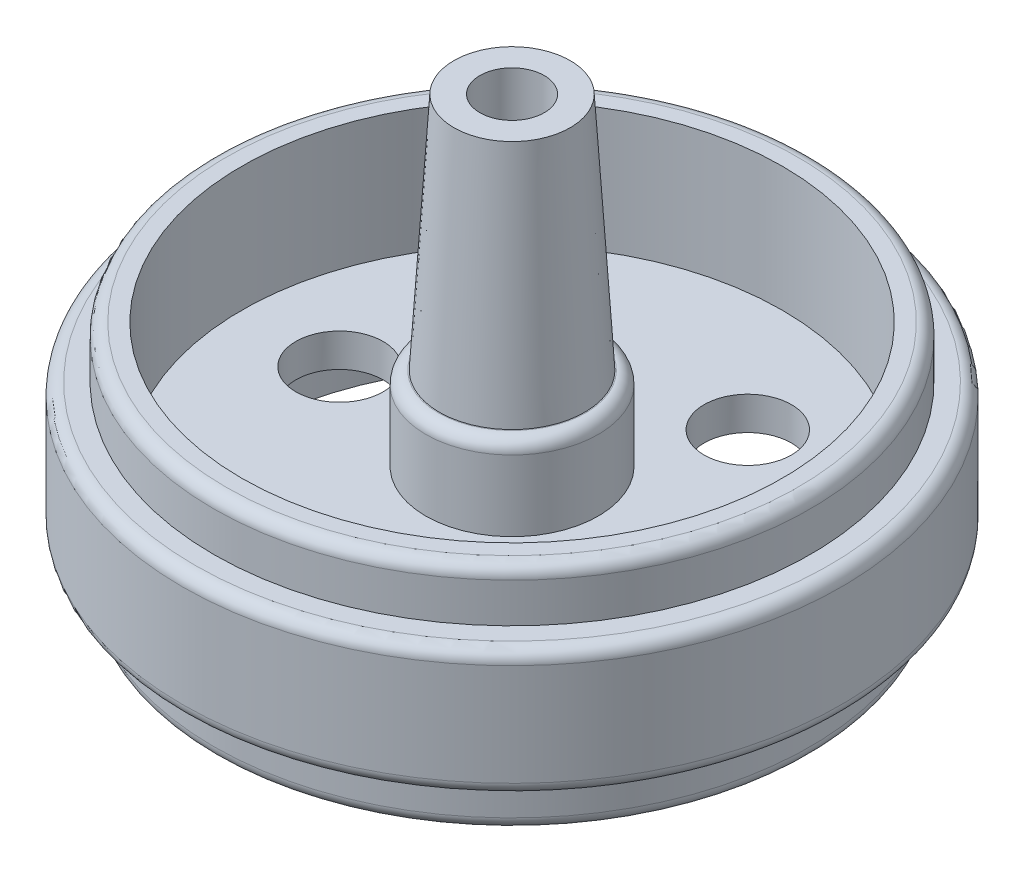
ISO-10303-21;
HEADER;
FILE_DESCRIPTION(('STEP AP214'),'2;1');
FILE_NAME('part.step','',(''),(''),'','','');
FILE_SCHEMA(('AUTOMOTIVE_DESIGN { 1 0 10303 214 1 1 1 1 }'));
ENDSEC;
DATA;
#1=APPLICATION_CONTEXT('core data for automotive mechanical design processes');
#2=APPLICATION_PROTOCOL_DEFINITION('international standard','automotive_design',2000,#1);
#3=PRODUCT_CONTEXT('',#1,'mechanical');
#4=PRODUCT('Part','Part','',(#3));
#5=PRODUCT_RELATED_PRODUCT_CATEGORY('part','',(#4));
#6=PRODUCT_DEFINITION_FORMATION('','',#4);
#7=PRODUCT_DEFINITION_CONTEXT('part definition',#1,'design');
#8=PRODUCT_DEFINITION('design','',#6,#7);
#9=PRODUCT_DEFINITION_SHAPE('','',#8);
#10=(LENGTH_UNIT() NAMED_UNIT(*) SI_UNIT(.MILLI.,.METRE.));
#11=(NAMED_UNIT(*) PLANE_ANGLE_UNIT() SI_UNIT($,.RADIAN.));
#12=(NAMED_UNIT(*) SI_UNIT($,.STERADIAN.) SOLID_ANGLE_UNIT());
#13=UNCERTAINTY_MEASURE_WITH_UNIT(LENGTH_MEASURE(1.E-05),#10,'distance_accuracy_value','');
#14=(GEOMETRIC_REPRESENTATION_CONTEXT(3) GLOBAL_UNCERTAINTY_ASSIGNED_CONTEXT((#13)) GLOBAL_UNIT_ASSIGNED_CONTEXT((#10,
#11,#12)) REPRESENTATION_CONTEXT('',''));
#15=CARTESIAN_POINT('',(0.,0.,0.));
#16=DIRECTION('',(0.,0.,1.));
#17=DIRECTION('',(1.,0.,0.));
#18=AXIS2_PLACEMENT_3D('',#15,#16,#17);
#19=CARTESIAN_POINT('',(0.,9.1,0.));
#20=DIRECTION('',(0.,1.,0.));
#21=DIRECTION('',(0.,0.,1.));
#22=AXIS2_PLACEMENT_3D('',#19,#20,#21);
#23=PLANE('',#22);
#24=CARTESIAN_POINT('',(0.,9.1,0.));
#25=DIRECTION('',(0.,1.,0.));
#26=DIRECTION('',(0.,0.,1.));
#27=AXIS2_PLACEMENT_3D('',#24,#25,#26);
#28=CIRCLE('',#27,3.55);
#29=CARTESIAN_POINT('',(0.,9.1,3.55));
#30=VERTEX_POINT('',#29);
#31=EDGE_CURVE('E111',#30,#30,#28,.T.);
#32=ORIENTED_EDGE('',*,*,#31,.T.);
#33=EDGE_LOOP('',(#32));
#34=FACE_BOUND('',#33,.T.);
#35=CARTESIAN_POINT('',(0.,9.1,0.));
#36=DIRECTION('',(0.,1.,0.));
#37=DIRECTION('',(0.,0.,1.));
#38=AXIS2_PLACEMENT_3D('',#35,#36,#37);
#39=CIRCLE('',#38,3.5);
#40=CARTESIAN_POINT('',(0.,9.1,3.5));
#41=VERTEX_POINT('',#40);
#42=EDGE_CURVE('E76',#41,#41,#39,.T.);
#43=ORIENTED_EDGE('',*,*,#42,.F.);
#44=EDGE_LOOP('',(#43));
#45=FACE_BOUND('',#44,.T.);
#46=ADVANCED_FACE('F31',(#34,#45),#23,.T.);
#47=CARTESIAN_POINT('',(0.,5.1,0.));
#48=DIRECTION('',(0.,1.,0.));
#49=DIRECTION('',(0.,0.,1.));
#50=AXIS2_PLACEMENT_3D('',#47,#48,#49);
#51=PLANE('',#50);
#52=CARTESIAN_POINT('',(4.14999995499993,5.1,7.18801077346859));
#53=DIRECTION('',(0.,1.,0.));
#54=DIRECTION('',(0.,0.,1.));
#55=AXIS2_PLACEMENT_3D('',#52,#53,#54);
#56=CIRCLE('',#55,2.1);
#57=CARTESIAN_POINT('',(4.14999995499993,5.1,9.28801077346859));
#58=VERTEX_POINT('',#57);
#59=EDGE_CURVE('E64',#58,#58,#56,.T.);
#60=ORIENTED_EDGE('',*,*,#59,.F.);
#61=EDGE_LOOP('',(#60));
#62=FACE_BOUND('',#61,.T.);
#63=CARTESIAN_POINT('',(4.14999995500003,5.1,-7.18801077346853));
#64=DIRECTION('',(0.,1.,0.));
#65=DIRECTION('',(0.,0.,1.));
#66=AXIS2_PLACEMENT_3D('',#63,#64,#65);
#67=CIRCLE('',#66,2.1);
#68=CARTESIAN_POINT('',(4.14999995500003,5.1,-5.08801077346854));
#69=VERTEX_POINT('',#68);
#70=EDGE_CURVE('E54',#69,#69,#67,.T.);
#71=ORIENTED_EDGE('',*,*,#70,.F.);
#72=EDGE_LOOP('',(#71));
#73=FACE_BOUND('',#72,.T.);
#74=CARTESIAN_POINT('',(-8.29999991,5.1,0.));
#75=DIRECTION('',(0.,1.,0.));
#76=DIRECTION('',(0.,0.,1.));
#77=AXIS2_PLACEMENT_3D('',#74,#75,#76);
#78=CIRCLE('',#77,2.1);
#79=CARTESIAN_POINT('',(-8.29999991,5.1,2.1));
#80=VERTEX_POINT('',#79);
#81=EDGE_CURVE('E51',#80,#80,#78,.T.);
#82=ORIENTED_EDGE('',*,*,#81,.F.);
#83=EDGE_LOOP('',(#82));
#84=FACE_BOUND('',#83,.T.);
#85=CARTESIAN_POINT('',(0.,5.1,0.));
#86=DIRECTION('',(0.,1.,0.));
#87=DIRECTION('',(0.,0.,1.));
#88=AXIS2_PLACEMENT_3D('',#85,#86,#87);
#89=CIRCLE('',#88,13.);
#90=CARTESIAN_POINT('',(0.,5.1,13.));
#91=VERTEX_POINT('',#90);
#92=EDGE_CURVE('E100',#91,#91,#89,.T.);
#93=ORIENTED_EDGE('',*,*,#92,.T.);
#94=EDGE_LOOP('',(#93));
#95=FACE_BOUND('',#94,.T.);
#96=CARTESIAN_POINT('',(0.,5.1,0.));
#97=DIRECTION('',(0.,1.,0.));
#98=DIRECTION('',(0.,0.,1.));
#99=AXIS2_PLACEMENT_3D('',#96,#97,#98);
#100=CIRCLE('',#99,4.15);
#101=CARTESIAN_POINT('',(0.,5.1,4.15));
#102=VERTEX_POINT('',#101);
#103=EDGE_CURVE('E84',#102,#102,#100,.T.);
#104=ORIENTED_EDGE('',*,*,#103,.F.);
#105=EDGE_LOOP('',(#104));
#106=FACE_BOUND('',#105,.T.);
#107=ADVANCED_FACE('F152',(#62,#73,#84,#95,#106),#51,.T.);
#108=CARTESIAN_POINT('',(0.,8.6,0.));
#109=DIRECTION('',(0.,1.,0.));
#110=DIRECTION('',(0.,0.,1.));
#111=AXIS2_PLACEMENT_3D('',#108,#109,#110);
#112=PLANE('',#111);
#113=CARTESIAN_POINT('',(0.,8.6,0.));
#114=DIRECTION('',(0.,1.,0.));
#115=DIRECTION('',(0.,0.,1.));
#116=AXIS2_PLACEMENT_3D('',#113,#114,#115);
#117=CIRCLE('',#116,15.25);
#118=CARTESIAN_POINT('',(0.,8.6,15.25));
#119=VERTEX_POINT('',#118);
#120=EDGE_CURVE('E44',#119,#119,#117,.T.);
#121=ORIENTED_EDGE('',*,*,#120,.T.);
#122=EDGE_LOOP('',(#121));
#123=FACE_BOUND('',#122,.T.);
#124=CARTESIAN_POINT('',(0.,8.6,0.));
#125=DIRECTION('',(0.,1.,0.));
#126=DIRECTION('',(0.,0.,1.));
#127=AXIS2_PLACEMENT_3D('',#124,#125,#126);
#128=CIRCLE('',#127,14.350000002);
#129=CARTESIAN_POINT('',(0.,8.6,14.350000002));
#130=VERTEX_POINT('',#129);
#131=EDGE_CURVE('E103',#130,#130,#128,.T.);
#132=ORIENTED_EDGE('',*,*,#131,.F.);
#133=EDGE_LOOP('',(#132));
#134=FACE_BOUND('',#133,.T.);
#135=ADVANCED_FACE('F134',(#123,#134),#112,.T.);
#136=CARTESIAN_POINT('',(0.,2.5,0.));
#137=DIRECTION('',(0.,-1.,0.));
#138=DIRECTION('',(0.,0.,-1.));
#139=AXIS2_PLACEMENT_3D('',#136,#137,#138);
#140=CYLINDRICAL_SURFACE('',#139,14.35);
#141=CARTESIAN_POINT('',(0.,0.6,0.));
#142=DIRECTION('',(0.,1.,0.));
#143=DIRECTION('',(0.,0.,1.));
#144=AXIS2_PLACEMENT_3D('',#141,#142,#143);
#145=CIRCLE('',#144,14.35);
#146=CARTESIAN_POINT('',(0.,0.6,14.35));
#147=VERTEX_POINT('',#146);
#148=EDGE_CURVE('E117',#147,#147,#145,.T.);
#149=ORIENTED_EDGE('',*,*,#148,.T.);
#150=EDGE_LOOP('',(#149));
#151=FACE_BOUND('',#150,.T.);
#152=CARTESIAN_POINT('',(0.,2.5,0.));
#153=DIRECTION('',(0.,1.,0.));
#154=DIRECTION('',(0.,0.,1.));
#155=AXIS2_PLACEMENT_3D('',#152,#153,#154);
#156=CIRCLE('',#155,14.35);
#157=CARTESIAN_POINT('',(0.,2.5,14.35));
#158=VERTEX_POINT('',#157);
#159=EDGE_CURVE('E108',#158,#158,#156,.T.);
#160=ORIENTED_EDGE('',*,*,#159,.F.);
#161=EDGE_LOOP('',(#160));
#162=FACE_BOUND('',#161,.T.);
#163=ADVANCED_FACE('F196',(#151,#162),#140,.T.);
#164=CARTESIAN_POINT('',(0.,0.,0.));
#165=DIRECTION('',(0.,1.,0.));
#166=DIRECTION('',(0.,0.,1.));
#167=AXIS2_PLACEMENT_3D('',#164,#165,#166);
#168=PLANE('',#167);
#169=CARTESIAN_POINT('',(0.,0.,0.));
#170=DIRECTION('',(0.,1.,0.));
#171=DIRECTION('',(0.,0.,1.));
#172=AXIS2_PLACEMENT_3D('',#169,#170,#171);
#173=CIRCLE('',#172,13.75);
#174=CARTESIAN_POINT('',(0.,0.,13.75));
#175=VERTEX_POINT('',#174);
#176=EDGE_CURVE('E120',#175,#175,#173,.F.);
#177=ORIENTED_EDGE('',*,*,#176,.T.);
#178=EDGE_LOOP('',(#177));
#179=FACE_BOUND('',#178,.T.);
#180=CARTESIAN_POINT('',(0.,0.,0.));
#181=DIRECTION('',(0.,-1.,0.));
#182=DIRECTION('',(0.,0.,-1.));
#183=AXIS2_PLACEMENT_3D('',#180,#181,#182);
#184=CIRCLE('',#183,13.05);
#185=CARTESIAN_POINT('',(0.,0.,-13.05));
#186=VERTEX_POINT('',#185);
#187=EDGE_CURVE('E91',#186,#186,#184,.T.);
#188=ORIENTED_EDGE('',*,*,#187,.F.);
#189=EDGE_LOOP('',(#188));
#190=FACE_BOUND('',#189,.T.);
#191=ADVANCED_FACE('F200',(#179,#190),#168,.F.);
#192=CARTESIAN_POINT('',(0.,2.5,0.));
#193=DIRECTION('',(0.,1.,0.));
#194=DIRECTION('',(0.,0.,1.));
#195=AXIS2_PLACEMENT_3D('',#192,#193,#194);
#196=PLANE('',#195);
#197=CARTESIAN_POINT('',(0.,2.5,0.));
#198=DIRECTION('',(0.,1.,0.));
#199=DIRECTION('',(0.,0.,1.));
#200=AXIS2_PLACEMENT_3D('',#197,#198,#199);
#201=CIRCLE('',#200,15.25);
#202=CARTESIAN_POINT('',(0.,2.5,15.25));
#203=VERTEX_POINT('',#202);
#204=EDGE_CURVE('E129',#203,#203,#201,.F.);
#205=ORIENTED_EDGE('',*,*,#204,.T.);
#206=EDGE_LOOP('',(#205));
#207=FACE_BOUND('',#206,.T.);
#208=ORIENTED_EDGE('',*,*,#159,.T.);
#209=EDGE_LOOP('',(#208));
#210=FACE_BOUND('',#209,.T.);
#211=ADVANCED_FACE('F197',(#207,#210),#196,.F.);
#212=CARTESIAN_POINT('',(0.,8.6,0.));
#213=DIRECTION('',(0.,-1.,0.));
#214=DIRECTION('',(0.,0.,-1.));
#215=AXIS2_PLACEMENT_3D('',#212,#213,#214);
#216=CYLINDRICAL_SURFACE('',#215,15.85);
#217=CARTESIAN_POINT('',(0.,3.1,0.));
#218=DIRECTION('',(0.,1.,0.));
#219=DIRECTION('',(0.,0.,1.));
#220=AXIS2_PLACEMENT_3D('',#217,#218,#219);
#221=CIRCLE('',#220,15.85);
#222=CARTESIAN_POINT('',(0.,3.1,15.85));
#223=VERTEX_POINT('',#222);
#224=EDGE_CURVE('E126',#223,#223,#221,.T.);
#225=ORIENTED_EDGE('',*,*,#224,.T.);
#226=EDGE_LOOP('',(#225));
#227=FACE_BOUND('',#226,.T.);
#228=CARTESIAN_POINT('',(0.,8.,0.));
#229=DIRECTION('',(0.,1.,0.));
#230=DIRECTION('',(0.,0.,1.));
#231=AXIS2_PLACEMENT_3D('',#228,#229,#230);
#232=CIRCLE('',#231,15.85);
#233=CARTESIAN_POINT('',(0.,8.,15.85));
#234=VERTEX_POINT('',#233);
#235=EDGE_CURVE('E123',#234,#234,#232,.F.);
#236=ORIENTED_EDGE('',*,*,#235,.T.);
#237=EDGE_LOOP('',(#236));
#238=FACE_BOUND('',#237,.T.);
#239=ADVANCED_FACE('F193',(#227,#238),#216,.T.);
#240=CARTESIAN_POINT('',(0.,11.1,0.));
#241=DIRECTION('',(0.,-1.,0.));
#242=DIRECTION('',(0.,0.,-1.));
#243=AXIS2_PLACEMENT_3D('',#240,#241,#242);
#244=CYLINDRICAL_SURFACE('',#243,14.350000002);
#245=CARTESIAN_POINT('',(0.,10.5,0.));
#246=DIRECTION('',(0.,1.,0.));
#247=DIRECTION('',(0.,0.,1.));
#248=AXIS2_PLACEMENT_3D('',#245,#246,#247);
#249=CIRCLE('',#248,14.350000002);
#250=CARTESIAN_POINT('',(0.,10.5,14.350000002));
#251=VERTEX_POINT('',#250);
#252=EDGE_CURVE('E10',#251,#251,#249,.F.);
#253=ORIENTED_EDGE('',*,*,#252,.T.);
#254=EDGE_LOOP('',(#253));
#255=FACE_BOUND('',#254,.T.);
#256=ORIENTED_EDGE('',*,*,#131,.T.);
#257=EDGE_LOOP('',(#256));
#258=FACE_BOUND('',#257,.T.);
#259=ADVANCED_FACE('F189',(#255,#258),#244,.T.);
#260=CARTESIAN_POINT('',(0.,11.1,0.));
#261=DIRECTION('',(0.,1.,0.));
#262=DIRECTION('',(0.,0.,1.));
#263=AXIS2_PLACEMENT_3D('',#260,#261,#262);
#264=PLANE('',#263);
#265=CARTESIAN_POINT('',(0.,11.1,0.));
#266=DIRECTION('',(0.,1.,0.));
#267=DIRECTION('',(0.,0.,1.));
#268=AXIS2_PLACEMENT_3D('',#265,#266,#267);
#269=CIRCLE('',#268,13.750000002);
#270=CARTESIAN_POINT('',(0.,11.1,13.750000002));
#271=VERTEX_POINT('',#270);
#272=EDGE_CURVE('E39',#271,#271,#269,.T.);
#273=ORIENTED_EDGE('',*,*,#272,.T.);
#274=EDGE_LOOP('',(#273));
#275=FACE_BOUND('',#274,.T.);
#276=CARTESIAN_POINT('',(0.,11.1,0.));
#277=DIRECTION('',(0.,1.,0.));
#278=DIRECTION('',(0.,0.,1.));
#279=AXIS2_PLACEMENT_3D('',#276,#277,#278);
#280=CIRCLE('',#279,13.);
#281=CARTESIAN_POINT('',(0.,11.1,13.));
#282=VERTEX_POINT('',#281);
#283=EDGE_CURVE('E97',#282,#282,#280,.T.);
#284=ORIENTED_EDGE('',*,*,#283,.F.);
#285=EDGE_LOOP('',(#284));
#286=FACE_BOUND('',#285,.T.);
#287=ADVANCED_FACE('F185',(#275,#286),#264,.T.);
#288=CARTESIAN_POINT('',(0.,5.1,0.));
#289=DIRECTION('',(0.,1.,0.));
#290=DIRECTION('',(0.,0.,1.));
#291=AXIS2_PLACEMENT_3D('',#288,#289,#290);
#292=CYLINDRICAL_SURFACE('',#291,13.);
#293=ORIENTED_EDGE('',*,*,#92,.F.);
#294=EDGE_LOOP('',(#293));
#295=FACE_BOUND('',#294,.T.);
#296=ORIENTED_EDGE('',*,*,#283,.T.);
#297=EDGE_LOOP('',(#296));
#298=FACE_BOUND('',#297,.T.);
#299=ADVANCED_FACE('F180',(#295,#298),#292,.F.);
#300=CARTESIAN_POINT('',(0.,3.5,0.));
#301=DIRECTION('',(0.,-1.,0.));
#302=DIRECTION('',(0.,0.,-1.));
#303=AXIS2_PLACEMENT_3D('',#300,#301,#302);
#304=CYLINDRICAL_SURFACE('',#303,13.05);
#305=CARTESIAN_POINT('',(0.,3.5,0.));
#306=DIRECTION('',(0.,-1.,0.));
#307=DIRECTION('',(0.,0.,-1.));
#308=AXIS2_PLACEMENT_3D('',#305,#306,#307);
#309=CIRCLE('',#308,13.05);
#310=CARTESIAN_POINT('',(0.,3.5,-13.05));
#311=VERTEX_POINT('',#310);
#312=EDGE_CURVE('E94',#311,#311,#309,.T.);
#313=ORIENTED_EDGE('',*,*,#312,.F.);
#314=EDGE_LOOP('',(#313));
#315=FACE_BOUND('',#314,.T.);
#316=ORIENTED_EDGE('',*,*,#187,.T.);
#317=EDGE_LOOP('',(#316));
#318=FACE_BOUND('',#317,.T.);
#319=ADVANCED_FACE('F177',(#315,#318),#304,.F.);
#320=CARTESIAN_POINT('',(0.,3.5,0.));
#321=DIRECTION('',(0.,-1.,0.));
#322=DIRECTION('',(0.,0.,-1.));
#323=AXIS2_PLACEMENT_3D('',#320,#321,#322);
#324=PLANE('',#323);
#325=CARTESIAN_POINT('',(4.14999995499993,3.5,7.18801077346859));
#326=DIRECTION('',(0.,-1.,0.));
#327=DIRECTION('',(0.,0.,-1.));
#328=AXIS2_PLACEMENT_3D('',#325,#326,#327);
#329=CIRCLE('',#328,2.1);
#330=CARTESIAN_POINT('',(4.14999995499993,3.5,5.08801077346859));
#331=VERTEX_POINT('',#330);
#332=EDGE_CURVE('E35',#331,#331,#329,.T.);
#333=ORIENTED_EDGE('',*,*,#332,.F.);
#334=EDGE_LOOP('',(#333));
#335=FACE_BOUND('',#334,.T.);
#336=CARTESIAN_POINT('',(4.14999995500003,3.5,-7.18801077346853));
#337=DIRECTION('',(0.,-1.,0.));
#338=DIRECTION('',(0.,0.,-1.));
#339=AXIS2_PLACEMENT_3D('',#336,#337,#338);
#340=CIRCLE('',#339,2.1);
#341=CARTESIAN_POINT('',(4.14999995500003,3.5,-9.28801077346853));
#342=VERTEX_POINT('',#341);
#343=EDGE_CURVE('E52',#342,#342,#340,.T.);
#344=ORIENTED_EDGE('',*,*,#343,.F.);
#345=EDGE_LOOP('',(#344));
#346=FACE_BOUND('',#345,.T.);
#347=CARTESIAN_POINT('',(-8.29999991,3.5,0.));
#348=DIRECTION('',(0.,-1.,0.));
#349=DIRECTION('',(0.,0.,-1.));
#350=AXIS2_PLACEMENT_3D('',#347,#348,#349);
#351=CIRCLE('',#350,2.1);
#352=CARTESIAN_POINT('',(-8.29999991,3.5,-2.1));
#353=VERTEX_POINT('',#352);
#354=EDGE_CURVE('E48',#353,#353,#351,.T.);
#355=ORIENTED_EDGE('',*,*,#354,.F.);
#356=EDGE_LOOP('',(#355));
#357=FACE_BOUND('',#356,.T.);
#358=CARTESIAN_POINT('',(0.,3.5,0.));
#359=DIRECTION('',(0.,-1.,0.));
#360=DIRECTION('',(0.,0.,-1.));
#361=AXIS2_PLACEMENT_3D('',#358,#359,#360);
#362=CIRCLE('',#361,4.3);
#363=CARTESIAN_POINT('',(0.,3.5,-4.3));
#364=VERTEX_POINT('',#363);
#365=EDGE_CURVE('E88',#364,#364,#362,.T.);
#366=ORIENTED_EDGE('',*,*,#365,.F.);
#367=EDGE_LOOP('',(#366));
#368=FACE_BOUND('',#367,.T.);
#369=ORIENTED_EDGE('',*,*,#312,.T.);
#370=EDGE_LOOP('',(#369));
#371=FACE_BOUND('',#370,.T.);
#372=ADVANCED_FACE('F173',(#335,#346,#357,#368,#371),#324,.T.);
#373=CARTESIAN_POINT('',(0.,3.5,0.));
#374=DIRECTION('',(0.,-1.,0.));
#375=DIRECTION('',(0.,0.,-1.));
#376=AXIS2_PLACEMENT_3D('',#373,#374,#375);
#377=CYLINDRICAL_SURFACE('',#376,4.3);
#378=ORIENTED_EDGE('',*,*,#365,.T.);
#379=EDGE_LOOP('',(#378));
#380=FACE_BOUND('',#379,.T.);
#381=CARTESIAN_POINT('',(0.,0.,0.));
#382=DIRECTION('',(0.,-1.,0.));
#383=DIRECTION('',(0.,0.,-1.));
#384=AXIS2_PLACEMENT_3D('',#381,#382,#383);
#385=CIRCLE('',#384,4.3);
#386=CARTESIAN_POINT('',(0.,0.,-4.3));
#387=VERTEX_POINT('',#386);
#388=EDGE_CURVE('E87',#387,#387,#385,.T.);
#389=ORIENTED_EDGE('',*,*,#388,.F.);
#390=EDGE_LOOP('',(#389));
#391=FACE_BOUND('',#390,.T.);
#392=ADVANCED_FACE('F170',(#380,#391),#377,.T.);
#393=CARTESIAN_POINT('',(0.,0.,0.));
#394=DIRECTION('',(0.,-1.,0.));
#395=DIRECTION('',(0.,0.,-1.));
#396=AXIS2_PLACEMENT_3D('',#393,#394,#395);
#397=CIRCLE('',#396,3.25);
#398=CARTESIAN_POINT('',(0.,0.,-3.25));
#399=VERTEX_POINT('',#398);
#400=EDGE_CURVE('E70',#399,#399,#397,.T.);
#401=ORIENTED_EDGE('',*,*,#400,.F.);
#402=EDGE_LOOP('',(#401));
#403=FACE_BOUND('',#402,.T.);
#404=ORIENTED_EDGE('',*,*,#388,.T.);
#405=EDGE_LOOP('',(#404));
#406=FACE_BOUND('',#405,.T.);
#407=ADVANCED_FACE('F168',(#403,#406),#168,.F.);
#408=CARTESIAN_POINT('',(0.,9.1,0.));
#409=DIRECTION('',(0.,-1.,0.));
#410=DIRECTION('',(0.,0.,-1.));
#411=AXIS2_PLACEMENT_3D('',#408,#409,#410);
#412=CYLINDRICAL_SURFACE('',#411,4.15);
#413=CARTESIAN_POINT('',(0.,8.5,0.));
#414=DIRECTION('',(0.,1.,0.));
#415=DIRECTION('',(0.,0.,1.));
#416=AXIS2_PLACEMENT_3D('',#413,#414,#415);
#417=CIRCLE('',#416,4.15);
#418=CARTESIAN_POINT('',(0.,8.5,4.15));
#419=VERTEX_POINT('',#418);
#420=EDGE_CURVE('E114',#419,#419,#417,.F.);
#421=ORIENTED_EDGE('',*,*,#420,.T.);
#422=EDGE_LOOP('',(#421));
#423=FACE_BOUND('',#422,.T.);
#424=ORIENTED_EDGE('',*,*,#103,.T.);
#425=EDGE_LOOP('',(#424));
#426=FACE_BOUND('',#425,.T.);
#427=ADVANCED_FACE('F165',(#423,#426),#412,.T.);
#428=CARTESIAN_POINT('',(0.,9.1,0.));
#429=DIRECTION('',(0.,-1.,0.));
#430=DIRECTION('',(0.,0.,1.));
#431=AXIS2_PLACEMENT_3D('',#428,#429,#430);
#432=CONICAL_SURFACE('',#431,3.5,0.0610865238198017);
#433=CARTESIAN_POINT('',(0.,20.6,0.));
#434=DIRECTION('',(0.,1.,0.));
#435=DIRECTION('',(0.,0.,1.));
#436=AXIS2_PLACEMENT_3D('',#433,#434,#435);
#437=CIRCLE('',#436,2.79662986826943);
#438=CARTESIAN_POINT('',(0.,20.6,2.79662986826943));
#439=VERTEX_POINT('',#438);
#440=EDGE_CURVE('E81',#439,#439,#437,.T.);
#441=ORIENTED_EDGE('',*,*,#440,.F.);
#442=EDGE_LOOP('',(#441));
#443=FACE_BOUND('',#442,.T.);
#444=ORIENTED_EDGE('',*,*,#42,.T.);
#445=EDGE_LOOP('',(#444));
#446=FACE_BOUND('',#445,.T.);
#447=ADVANCED_FACE('F163',(#443,#446),#432,.T.);
#448=CARTESIAN_POINT('',(0.,20.6,0.));
#449=DIRECTION('',(0.,1.,0.));
#450=DIRECTION('',(0.,0.,1.));
#451=AXIS2_PLACEMENT_3D('',#448,#449,#450);
#452=PLANE('',#451);
#453=CARTESIAN_POINT('',(0.,20.6,0.));
#454=DIRECTION('',(0.,1.,0.));
#455=DIRECTION('',(0.,0.,1.));
#456=AXIS2_PLACEMENT_3D('',#453,#454,#455);
#457=CIRCLE('',#456,1.55);
#458=CARTESIAN_POINT('',(0.,20.6,1.55));
#459=VERTEX_POINT('',#458);
#460=EDGE_CURVE('E67',#459,#459,#457,.T.);
#461=ORIENTED_EDGE('',*,*,#460,.F.);
#462=EDGE_LOOP('',(#461));
#463=FACE_BOUND('',#462,.T.);
#464=ORIENTED_EDGE('',*,*,#440,.T.);
#465=EDGE_LOOP('',(#464));
#466=FACE_BOUND('',#465,.T.);
#467=ADVANCED_FACE('F303',(#463,#466),#452,.T.);
#468=CARTESIAN_POINT('',(0.,6.65,0.));
#469=DIRECTION('',(0.,-1.,0.));
#470=DIRECTION('',(0.,0.,-1.));
#471=AXIS2_PLACEMENT_3D('',#468,#469,#470);
#472=CYLINDRICAL_SURFACE('',#471,3.25);
#473=CARTESIAN_POINT('',(0.,6.65,0.));
#474=DIRECTION('',(0.,-1.,0.));
#475=DIRECTION('',(0.,0.,-1.));
#476=AXIS2_PLACEMENT_3D('',#473,#474,#475);
#477=CIRCLE('',#476,3.25);
#478=CARTESIAN_POINT('',(0.,6.65,-3.25));
#479=VERTEX_POINT('',#478);
#480=EDGE_CURVE('E73',#479,#479,#477,.T.);
#481=ORIENTED_EDGE('',*,*,#480,.F.);
#482=EDGE_LOOP('',(#481));
#483=FACE_BOUND('',#482,.T.);
#484=ORIENTED_EDGE('',*,*,#400,.T.);
#485=EDGE_LOOP('',(#484));
#486=FACE_BOUND('',#485,.T.);
#487=ADVANCED_FACE('F300',(#483,#486),#472,.F.);
#488=CARTESIAN_POINT('',(0.,6.65,0.));
#489=DIRECTION('',(0.,-1.,0.));
#490=DIRECTION('',(0.,0.,-1.));
#491=AXIS2_PLACEMENT_3D('',#488,#489,#490);
#492=PLANE('',#491);
#493=CARTESIAN_POINT('',(0.,6.65,0.));
#494=DIRECTION('',(0.,-1.,0.));
#495=DIRECTION('',(0.,0.,-1.));
#496=AXIS2_PLACEMENT_3D('',#493,#494,#495);
#497=CIRCLE('',#496,1.55);
#498=CARTESIAN_POINT('',(0.,6.65,-1.55));
#499=VERTEX_POINT('',#498);
#500=EDGE_CURVE('E50',#499,#499,#497,.F.);
#501=ORIENTED_EDGE('',*,*,#500,.T.);
#502=EDGE_LOOP('',(#501));
#503=FACE_BOUND('',#502,.T.);
#504=ORIENTED_EDGE('',*,*,#480,.T.);
#505=EDGE_LOOP('',(#504));
#506=FACE_BOUND('',#505,.T.);
#507=ADVANCED_FACE('F296',(#503,#506),#492,.T.);
#508=CARTESIAN_POINT('',(0.,-0.001000000000001,0.));
#509=DIRECTION('',(0.,1.,0.));
#510=DIRECTION('',(0.,0.,1.));
#511=AXIS2_PLACEMENT_3D('',#508,#509,#510);
#512=CYLINDRICAL_SURFACE('',#511,1.55);
#513=ORIENTED_EDGE('',*,*,#500,.F.);
#514=EDGE_LOOP('',(#513));
#515=FACE_BOUND('',#514,.T.);
#516=ORIENTED_EDGE('',*,*,#460,.T.);
#517=EDGE_LOOP('',(#516));
#518=FACE_BOUND('',#517,.T.);
#519=ADVANCED_FACE('F214',(#515,#518),#512,.F.);
#520=CARTESIAN_POINT('',(0.,8.5,0.));
#521=DIRECTION('',(0.,1.,0.));
#522=DIRECTION('',(0.,0.,1.));
#523=AXIS2_PLACEMENT_3D('',#520,#521,#522);
#524=TOROIDAL_SURFACE('',#523,3.55,0.6);
#525=ORIENTED_EDGE('',*,*,#420,.F.);
#526=EDGE_LOOP('',(#525));
#527=FACE_BOUND('',#526,.T.);
#528=ORIENTED_EDGE('',*,*,#31,.F.);
#529=EDGE_LOOP('',(#528));
#530=FACE_BOUND('',#529,.T.);
#531=ADVANCED_FACE('F211',(#527,#530),#524,.T.);
#532=CARTESIAN_POINT('',(0.,0.6,0.));
#533=DIRECTION('',(0.,1.,0.));
#534=DIRECTION('',(0.,0.,1.));
#535=AXIS2_PLACEMENT_3D('',#532,#533,#534);
#536=TOROIDAL_SURFACE('',#535,13.75,0.6);
#537=ORIENTED_EDGE('',*,*,#176,.F.);
#538=EDGE_LOOP('',(#537));
#539=FACE_BOUND('',#538,.T.);
#540=ORIENTED_EDGE('',*,*,#148,.F.);
#541=EDGE_LOOP('',(#540));
#542=FACE_BOUND('',#541,.T.);
#543=ADVANCED_FACE('F147',(#539,#542),#536,.T.);
#544=CARTESIAN_POINT('',(0.,3.1,0.));
#545=DIRECTION('',(0.,1.,0.));
#546=DIRECTION('',(0.,0.,1.));
#547=AXIS2_PLACEMENT_3D('',#544,#545,#546);
#548=TOROIDAL_SURFACE('',#547,15.25,0.6);
#549=ORIENTED_EDGE('',*,*,#204,.F.);
#550=EDGE_LOOP('',(#549));
#551=FACE_BOUND('',#550,.T.);
#552=ORIENTED_EDGE('',*,*,#224,.F.);
#553=EDGE_LOOP('',(#552));
#554=FACE_BOUND('',#553,.T.);
#555=ADVANCED_FACE('F139',(#551,#554),#548,.T.);
#556=CARTESIAN_POINT('',(0.,8.,0.));
#557=DIRECTION('',(0.,1.,0.));
#558=DIRECTION('',(0.,0.,1.));
#559=AXIS2_PLACEMENT_3D('',#556,#557,#558);
#560=TOROIDAL_SURFACE('',#559,15.25,0.6);
#561=ORIENTED_EDGE('',*,*,#235,.F.);
#562=EDGE_LOOP('',(#561));
#563=FACE_BOUND('',#562,.T.);
#564=ORIENTED_EDGE('',*,*,#120,.F.);
#565=EDGE_LOOP('',(#564));
#566=FACE_BOUND('',#565,.T.);
#567=ADVANCED_FACE('F137',(#563,#566),#560,.T.);
#568=CARTESIAN_POINT('',(0.,10.5,0.));
#569=DIRECTION('',(0.,1.,0.));
#570=DIRECTION('',(0.,0.,1.));
#571=AXIS2_PLACEMENT_3D('',#568,#569,#570);
#572=TOROIDAL_SURFACE('',#571,13.750000002,0.6);
#573=ORIENTED_EDGE('',*,*,#252,.F.);
#574=EDGE_LOOP('',(#573));
#575=FACE_BOUND('',#574,.T.);
#576=ORIENTED_EDGE('',*,*,#272,.F.);
#577=EDGE_LOOP('',(#576));
#578=FACE_BOUND('',#577,.T.);
#579=ADVANCED_FACE('F33',(#575,#578),#572,.T.);
#580=CARTESIAN_POINT('',(-8.29999991,0.,0.));
#581=DIRECTION('',(0.,1.,0.));
#582=DIRECTION('',(0.,0.,1.));
#583=AXIS2_PLACEMENT_3D('',#580,#581,#582);
#584=CYLINDRICAL_SURFACE('',#583,2.1);
#585=ORIENTED_EDGE('',*,*,#354,.T.);
#586=EDGE_LOOP('',(#585));
#587=FACE_BOUND('',#586,.T.);
#588=ORIENTED_EDGE('',*,*,#81,.T.);
#589=EDGE_LOOP('',(#588));
#590=FACE_BOUND('',#589,.T.);
#591=ADVANCED_FACE('F145',(#587,#590),#584,.F.);
#592=CARTESIAN_POINT('',(4.14999995500003,0.,-7.18801077346853));
#593=DIRECTION('',(0.,1.,0.));
#594=DIRECTION('',(0.,0.,1.));
#595=AXIS2_PLACEMENT_3D('',#592,#593,#594);
#596=CYLINDRICAL_SURFACE('',#595,2.1);
#597=ORIENTED_EDGE('',*,*,#343,.T.);
#598=EDGE_LOOP('',(#597));
#599=FACE_BOUND('',#598,.T.);
#600=ORIENTED_EDGE('',*,*,#70,.T.);
#601=EDGE_LOOP('',(#600));
#602=FACE_BOUND('',#601,.T.);
#603=ADVANCED_FACE('F270',(#599,#602),#596,.F.);
#604=CARTESIAN_POINT('',(4.14999995499993,0.,7.18801077346859));
#605=DIRECTION('',(0.,1.,0.));
#606=DIRECTION('',(0.,0.,1.));
#607=AXIS2_PLACEMENT_3D('',#604,#605,#606);
#608=CYLINDRICAL_SURFACE('',#607,2.1);
#609=ORIENTED_EDGE('',*,*,#332,.T.);
#610=EDGE_LOOP('',(#609));
#611=FACE_BOUND('',#610,.T.);
#612=ORIENTED_EDGE('',*,*,#59,.T.);
#613=EDGE_LOOP('',(#612));
#614=FACE_BOUND('',#613,.T.);
#615=ADVANCED_FACE('F280',(#611,#614),#608,.F.);
#616=CLOSED_SHELL('',(#46,#107,#135,#163,#191,#211,#239,#259,#287,#299,#319,#372,#392,#407,#427,
#447,#467,#487,#507,#519,#531,#543,#555,#567,#579,#591,#603,#615));
#617=MANIFOLD_SOLID_BREP('B2',#616);
#618=ADVANCED_BREP_SHAPE_REPRESENTATION('',(#18,#617),#14);
#619=SHAPE_DEFINITION_REPRESENTATION(#9,#618);
ENDSEC;
END-ISO-10303-21;
